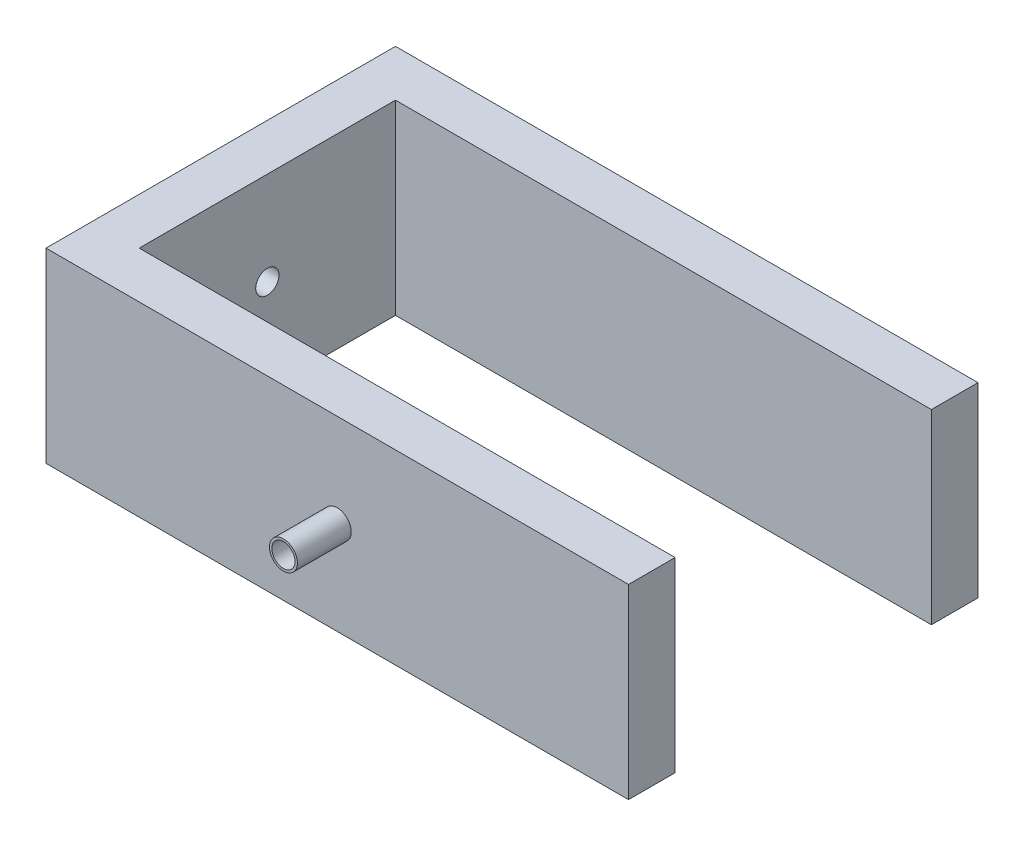
ISO-10303-21;
HEADER;
FILE_DESCRIPTION(('STEP AP214'),'2;1');
FILE_NAME('part.step','',(''),(''),'','','');
FILE_SCHEMA(('AUTOMOTIVE_DESIGN { 1 0 10303 214 1 1 1 1 }'));
ENDSEC;
DATA;
#1=APPLICATION_CONTEXT('core data for automotive mechanical design processes');
#2=APPLICATION_PROTOCOL_DEFINITION('international standard','automotive_design',2000,#1);
#3=PRODUCT_CONTEXT('',#1,'mechanical');
#4=PRODUCT('Part','Part','',(#3));
#5=PRODUCT_RELATED_PRODUCT_CATEGORY('part','',(#4));
#6=PRODUCT_DEFINITION_FORMATION('','',#4);
#7=PRODUCT_DEFINITION_CONTEXT('part definition',#1,'design');
#8=PRODUCT_DEFINITION('design','',#6,#7);
#9=PRODUCT_DEFINITION_SHAPE('','',#8);
#10=(LENGTH_UNIT() NAMED_UNIT(*) SI_UNIT(.MILLI.,.METRE.));
#11=(NAMED_UNIT(*) PLANE_ANGLE_UNIT() SI_UNIT($,.RADIAN.));
#12=(NAMED_UNIT(*) SI_UNIT($,.STERADIAN.) SOLID_ANGLE_UNIT());
#13=UNCERTAINTY_MEASURE_WITH_UNIT(LENGTH_MEASURE(1.E-05),#10,'distance_accuracy_value','');
#14=(GEOMETRIC_REPRESENTATION_CONTEXT(3) GLOBAL_UNCERTAINTY_ASSIGNED_CONTEXT((#13)) GLOBAL_UNIT_ASSIGNED_CONTEXT((#10,
#11,#12)) REPRESENTATION_CONTEXT('',''));
#15=CARTESIAN_POINT('',(0.,0.,0.));
#16=DIRECTION('',(0.,0.,1.));
#17=DIRECTION('',(1.,0.,0.));
#18=AXIS2_PLACEMENT_3D('',#15,#16,#17);
#19=CARTESIAN_POINT('',(10.,0.,0.));
#20=DIRECTION('',(1.,0.,0.));
#21=DIRECTION('',(0.,0.,-1.));
#22=AXIS2_PLACEMENT_3D('',#19,#20,#21);
#23=PLANE('',#22);
#24=CARTESIAN_POINT('',(10.,0.,0.));
#25=DIRECTION('',(1.,0.,0.));
#26=DIRECTION('',(0.,0.,-1.));
#27=AXIS2_PLACEMENT_3D('',#24,#25,#26);
#28=CIRCLE('',#27,2.5);
#29=CARTESIAN_POINT('',(10.,0.,-2.5));
#30=VERTEX_POINT('',#29);
#31=EDGE_CURVE('E147',#30,#30,#28,.T.);
#32=ORIENTED_EDGE('',*,*,#31,.F.);
#33=EDGE_LOOP('',(#32));
#34=FACE_BOUND('',#33,.T.);
#35=DIRECTION('',(0.,0.,1.));
#36=VECTOR('',#35,1.);
#37=CARTESIAN_POINT('',(10.,20.,37.5));
#38=LINE('',#37,#36);
#39=CARTESIAN_POINT('',(10.,20.,-27.5));
#40=VERTEX_POINT('',#39);
#41=CARTESIAN_POINT('',(10.,20.,27.5));
#42=VERTEX_POINT('',#41);
#43=EDGE_CURVE('E52',#40,#42,#38,.T.);
#44=ORIENTED_EDGE('',*,*,#43,.T.);
#45=DIRECTION('',(0.,-1.,0.));
#46=VECTOR('',#45,1.);
#47=CARTESIAN_POINT('',(10.,0.,27.5));
#48=LINE('',#47,#46);
#49=CARTESIAN_POINT('',(10.,-20.,27.5));
#50=VERTEX_POINT('',#49);
#51=EDGE_CURVE('E47',#42,#50,#48,.T.);
#52=ORIENTED_EDGE('',*,*,#51,.T.);
#53=DIRECTION('',(0.,0.,-1.));
#54=VECTOR('',#53,1.);
#55=CARTESIAN_POINT('',(10.,-20.,37.5));
#56=LINE('',#55,#54);
#57=CARTESIAN_POINT('',(10.,-20.,-27.5));
#58=VERTEX_POINT('',#57);
#59=EDGE_CURVE('E102',#50,#58,#56,.T.);
#60=ORIENTED_EDGE('',*,*,#59,.T.);
#61=DIRECTION('',(0.,-1.,0.));
#62=VECTOR('',#61,1.);
#63=CARTESIAN_POINT('',(10.,0.,-27.5));
#64=LINE('',#63,#62);
#65=EDGE_CURVE('E141',#40,#58,#64,.T.);
#66=ORIENTED_EDGE('',*,*,#65,.F.);
#67=EDGE_LOOP('',(#44,#52,#60,#66));
#68=FACE_BOUND('',#67,.T.);
#69=ADVANCED_FACE('F32',(#34,#68),#23,.T.);
#70=CARTESIAN_POINT('',(0.,0.,0.));
#71=DIRECTION('',(1.,0.,0.));
#72=DIRECTION('',(0.,0.,-1.));
#73=AXIS2_PLACEMENT_3D('',#70,#71,#72);
#74=PLANE('',#73);
#75=DIRECTION('',(0.,-1.,0.));
#76=VECTOR('',#75,1.);
#77=CARTESIAN_POINT('',(0.,20.,37.5));
#78=LINE('',#77,#76);
#79=CARTESIAN_POINT('',(0.,20.,37.5));
#80=VERTEX_POINT('',#79);
#81=CARTESIAN_POINT('',(0.,-20.,37.5));
#82=VERTEX_POINT('',#81);
#83=EDGE_CURVE('E150',#80,#82,#78,.T.);
#84=ORIENTED_EDGE('',*,*,#83,.F.);
#85=DIRECTION('',(0.,0.,1.));
#86=VECTOR('',#85,1.);
#87=CARTESIAN_POINT('',(0.,20.,37.5));
#88=LINE('',#87,#86);
#89=CARTESIAN_POINT('',(0.,20.,-37.5));
#90=VERTEX_POINT('',#89);
#91=EDGE_CURVE('E154',#90,#80,#88,.T.);
#92=ORIENTED_EDGE('',*,*,#91,.F.);
#93=DIRECTION('',(0.,1.,0.));
#94=VECTOR('',#93,1.);
#95=CARTESIAN_POINT('',(0.,20.,-37.5));
#96=LINE('',#95,#94);
#97=CARTESIAN_POINT('',(0.,-20.,-37.5));
#98=VERTEX_POINT('',#97);
#99=EDGE_CURVE('E161',#98,#90,#96,.T.);
#100=ORIENTED_EDGE('',*,*,#99,.F.);
#101=DIRECTION('',(0.,0.,-1.));
#102=VECTOR('',#101,1.);
#103=CARTESIAN_POINT('',(0.,-20.,37.5));
#104=LINE('',#103,#102);
#105=EDGE_CURVE('E159',#82,#98,#104,.T.);
#106=ORIENTED_EDGE('',*,*,#105,.F.);
#107=EDGE_LOOP('',(#84,#92,#100,#106));
#108=FACE_BOUND('',#107,.T.);
#109=CARTESIAN_POINT('',(0.,0.,0.));
#110=DIRECTION('',(1.,0.,0.));
#111=DIRECTION('',(0.,0.,-1.));
#112=AXIS2_PLACEMENT_3D('',#109,#110,#111);
#113=CIRCLE('',#112,2.5);
#114=CARTESIAN_POINT('',(0.,0.,-2.5));
#115=VERTEX_POINT('',#114);
#116=EDGE_CURVE('E146',#115,#115,#113,.T.);
#117=ORIENTED_EDGE('',*,*,#116,.T.);
#118=EDGE_LOOP('',(#117));
#119=FACE_BOUND('',#118,.T.);
#120=ADVANCED_FACE('F190',(#108,#119),#74,.F.);
#121=CARTESIAN_POINT('',(10.,20.,37.5));
#122=DIRECTION('',(0.,0.,-1.));
#123=DIRECTION('',(0.,1.,0.));
#124=AXIS2_PLACEMENT_3D('',#121,#122,#123);
#125=PLANE('',#124);
#126=CARTESIAN_POINT('',(62.5,0.,37.5));
#127=DIRECTION('',(0.,0.,-1.));
#128=DIRECTION('',(-1.,0.,0.));
#129=AXIS2_PLACEMENT_3D('',#126,#127,#128);
#130=CIRCLE('',#129,3.00000000000001);
#131=CARTESIAN_POINT('',(59.5,0.,37.5));
#132=VERTEX_POINT('',#131);
#133=EDGE_CURVE('E376',#132,#132,#130,.T.);
#134=ORIENTED_EDGE('',*,*,#133,.T.);
#135=EDGE_LOOP('',(#134));
#136=FACE_BOUND('',#135,.T.);
#137=ORIENTED_EDGE('',*,*,#83,.T.);
#138=DIRECTION('',(-1.,0.,0.));
#139=VECTOR('',#138,1.);
#140=CARTESIAN_POINT('',(10.,-20.,37.5));
#141=LINE('',#140,#139);
#142=CARTESIAN_POINT('',(125.,-20.,37.5));
#143=VERTEX_POINT('',#142);
#144=EDGE_CURVE('E172',#143,#82,#141,.T.);
#145=ORIENTED_EDGE('',*,*,#144,.F.);
#146=DIRECTION('',(0.,1.,0.));
#147=VECTOR('',#146,1.);
#148=CARTESIAN_POINT('',(125.,20.,37.5));
#149=LINE('',#148,#147);
#150=CARTESIAN_POINT('',(125.,20.,37.5));
#151=VERTEX_POINT('',#150);
#152=EDGE_CURVE('E106',#143,#151,#149,.T.);
#153=ORIENTED_EDGE('',*,*,#152,.T.);
#154=DIRECTION('',(-1.,0.,0.));
#155=VECTOR('',#154,1.);
#156=CARTESIAN_POINT('',(10.,20.,37.5));
#157=LINE('',#156,#155);
#158=EDGE_CURVE('E156',#151,#80,#157,.T.);
#159=ORIENTED_EDGE('',*,*,#158,.T.);
#160=EDGE_LOOP('',(#137,#145,#153,#159));
#161=FACE_BOUND('',#160,.T.);
#162=ADVANCED_FACE('F34',(#136,#161),#125,.F.);
#163=CARTESIAN_POINT('',(10.,-20.,37.5));
#164=DIRECTION('',(0.,1.,0.));
#165=DIRECTION('',(0.,0.,1.));
#166=AXIS2_PLACEMENT_3D('',#163,#164,#165);
#167=PLANE('',#166);
#168=ORIENTED_EDGE('',*,*,#105,.T.);
#169=DIRECTION('',(-1.,0.,0.));
#170=VECTOR('',#169,1.);
#171=CARTESIAN_POINT('',(10.,-20.,-37.5));
#172=LINE('',#171,#170);
#173=CARTESIAN_POINT('',(125.,-20.,-37.5));
#174=VERTEX_POINT('',#173);
#175=EDGE_CURVE('E169',#174,#98,#172,.T.);
#176=ORIENTED_EDGE('',*,*,#175,.F.);
#177=DIRECTION('',(0.,0.,-1.));
#178=VECTOR('',#177,1.);
#179=CARTESIAN_POINT('',(125.,-20.,-27.5));
#180=LINE('',#179,#178);
#181=CARTESIAN_POINT('',(125.,-20.,-27.5));
#182=VERTEX_POINT('',#181);
#183=EDGE_CURVE('E138',#182,#174,#180,.T.);
#184=ORIENTED_EDGE('',*,*,#183,.F.);
#185=DIRECTION('',(-1.,0.,0.));
#186=VECTOR('',#185,1.);
#187=CARTESIAN_POINT('',(0.,-20.,-27.5));
#188=LINE('',#187,#186);
#189=EDGE_CURVE('E133',#182,#58,#188,.T.);
#190=ORIENTED_EDGE('',*,*,#189,.T.);
#191=ORIENTED_EDGE('',*,*,#59,.F.);
#192=DIRECTION('',(1.,0.,0.));
#193=VECTOR('',#192,1.);
#194=CARTESIAN_POINT('',(0.,-20.,27.5));
#195=LINE('',#194,#193);
#196=CARTESIAN_POINT('',(125.,-20.,27.5));
#197=VERTEX_POINT('',#196);
#198=EDGE_CURVE('E95',#50,#197,#195,.T.);
#199=ORIENTED_EDGE('',*,*,#198,.T.);
#200=DIRECTION('',(0.,0.,1.));
#201=VECTOR('',#200,1.);
#202=CARTESIAN_POINT('',(125.,-20.,27.5));
#203=LINE('',#202,#201);
#204=EDGE_CURVE('E99',#197,#143,#203,.T.);
#205=ORIENTED_EDGE('',*,*,#204,.T.);
#206=ORIENTED_EDGE('',*,*,#144,.T.);
#207=EDGE_LOOP('',(#168,#176,#184,#190,#191,#199,#205,#206));
#208=FACE_BOUND('',#207,.T.);
#209=ADVANCED_FACE('F97',(#208),#167,.F.);
#210=CARTESIAN_POINT('',(10.,20.,-37.5));
#211=DIRECTION('',(0.,0.,1.));
#212=DIRECTION('',(1.,0.,0.));
#213=AXIS2_PLACEMENT_3D('',#210,#211,#212);
#214=PLANE('',#213);
#215=CARTESIAN_POINT('',(62.5,0.,-37.5));
#216=DIRECTION('',(0.,0.,1.));
#217=DIRECTION('',(1.,0.,0.));
#218=AXIS2_PLACEMENT_3D('',#215,#216,#217);
#219=CIRCLE('',#218,2.49999999999999);
#220=CARTESIAN_POINT('',(65.,0.,-37.5));
#221=VERTEX_POINT('',#220);
#222=EDGE_CURVE('E40',#221,#221,#219,.F.);
#223=ORIENTED_EDGE('',*,*,#222,.F.);
#224=EDGE_LOOP('',(#223));
#225=FACE_BOUND('',#224,.T.);
#226=ORIENTED_EDGE('',*,*,#99,.T.);
#227=DIRECTION('',(-1.,0.,0.));
#228=VECTOR('',#227,1.);
#229=CARTESIAN_POINT('',(10.,20.,-37.5));
#230=LINE('',#229,#228);
#231=CARTESIAN_POINT('',(125.,20.,-37.5));
#232=VERTEX_POINT('',#231);
#233=EDGE_CURVE('E166',#232,#90,#230,.T.);
#234=ORIENTED_EDGE('',*,*,#233,.F.);
#235=DIRECTION('',(0.,-1.,0.));
#236=VECTOR('',#235,1.);
#237=CARTESIAN_POINT('',(125.,20.,-37.5));
#238=LINE('',#237,#236);
#239=EDGE_CURVE('E127',#232,#174,#238,.T.);
#240=ORIENTED_EDGE('',*,*,#239,.T.);
#241=ORIENTED_EDGE('',*,*,#175,.T.);
#242=EDGE_LOOP('',(#226,#234,#240,#241));
#243=FACE_BOUND('',#242,.T.);
#244=ADVANCED_FACE('F178',(#225,#243),#214,.F.);
#245=CARTESIAN_POINT('',(10.,20.,37.5));
#246=DIRECTION('',(0.,-1.,0.));
#247=DIRECTION('',(0.,0.,-1.));
#248=AXIS2_PLACEMENT_3D('',#245,#246,#247);
#249=PLANE('',#248);
#250=ORIENTED_EDGE('',*,*,#158,.F.);
#251=DIRECTION('',(0.,0.,1.));
#252=VECTOR('',#251,1.);
#253=CARTESIAN_POINT('',(125.,20.,27.5));
#254=LINE('',#253,#252);
#255=CARTESIAN_POINT('',(125.,20.,27.5));
#256=VERTEX_POINT('',#255);
#257=EDGE_CURVE('E114',#256,#151,#254,.T.);
#258=ORIENTED_EDGE('',*,*,#257,.F.);
#259=DIRECTION('',(-1.,0.,0.));
#260=VECTOR('',#259,1.);
#261=CARTESIAN_POINT('',(0.,20.,27.5));
#262=LINE('',#261,#260);
#263=EDGE_CURVE('E115',#256,#42,#262,.T.);
#264=ORIENTED_EDGE('',*,*,#263,.T.);
#265=ORIENTED_EDGE('',*,*,#43,.F.);
#266=DIRECTION('',(1.,0.,0.));
#267=VECTOR('',#266,1.);
#268=CARTESIAN_POINT('',(0.,20.,-27.5));
#269=LINE('',#268,#267);
#270=CARTESIAN_POINT('',(125.,20.,-27.5));
#271=VERTEX_POINT('',#270);
#272=EDGE_CURVE('E128',#40,#271,#269,.T.);
#273=ORIENTED_EDGE('',*,*,#272,.T.);
#274=DIRECTION('',(0.,0.,-1.));
#275=VECTOR('',#274,1.);
#276=CARTESIAN_POINT('',(125.,20.,-27.5));
#277=LINE('',#276,#275);
#278=EDGE_CURVE('E135',#271,#232,#277,.T.);
#279=ORIENTED_EDGE('',*,*,#278,.T.);
#280=ORIENTED_EDGE('',*,*,#233,.T.);
#281=ORIENTED_EDGE('',*,*,#91,.T.);
#282=EDGE_LOOP('',(#250,#258,#264,#265,#273,#279,#280,#281));
#283=FACE_BOUND('',#282,.T.);
#284=ADVANCED_FACE('F181',(#283),#249,.F.);
#285=CARTESIAN_POINT('',(10.,0.,0.));
#286=DIRECTION('',(-1.,0.,0.));
#287=DIRECTION('',(0.,0.,1.));
#288=AXIS2_PLACEMENT_3D('',#285,#286,#287);
#289=CYLINDRICAL_SURFACE('',#288,2.5);
#290=ORIENTED_EDGE('',*,*,#31,.T.);
#291=EDGE_LOOP('',(#290));
#292=FACE_BOUND('',#291,.T.);
#293=ORIENTED_EDGE('',*,*,#116,.F.);
#294=EDGE_LOOP('',(#293));
#295=FACE_BOUND('',#294,.T.);
#296=ADVANCED_FACE('F201',(#292,#295),#289,.F.);
#297=CARTESIAN_POINT('',(125.,20.,-27.5));
#298=DIRECTION('',(1.,0.,0.));
#299=DIRECTION('',(0.,0.,-1.));
#300=AXIS2_PLACEMENT_3D('',#297,#298,#299);
#301=PLANE('',#300);
#302=ORIENTED_EDGE('',*,*,#239,.F.);
#303=ORIENTED_EDGE('',*,*,#278,.F.);
#304=DIRECTION('',(0.,-1.,0.));
#305=VECTOR('',#304,1.);
#306=CARTESIAN_POINT('',(125.,20.,-27.5));
#307=LINE('',#306,#305);
#308=EDGE_CURVE('E130',#271,#182,#307,.T.);
#309=ORIENTED_EDGE('',*,*,#308,.T.);
#310=ORIENTED_EDGE('',*,*,#183,.T.);
#311=EDGE_LOOP('',(#302,#303,#309,#310));
#312=FACE_BOUND('',#311,.T.);
#313=ADVANCED_FACE('F199',(#312),#301,.T.);
#314=CARTESIAN_POINT('',(0.,0.,-27.5));
#315=DIRECTION('',(0.,0.,1.));
#316=DIRECTION('',(1.,0.,0.));
#317=AXIS2_PLACEMENT_3D('',#314,#315,#316);
#318=PLANE('',#317);
#319=ORIENTED_EDGE('',*,*,#272,.F.);
#320=ORIENTED_EDGE('',*,*,#65,.T.);
#321=ORIENTED_EDGE('',*,*,#189,.F.);
#322=ORIENTED_EDGE('',*,*,#308,.F.);
#323=EDGE_LOOP('',(#319,#320,#321,#322));
#324=FACE_BOUND('',#323,.T.);
#325=ADVANCED_FACE('F196',(#324),#318,.T.);
#326=CARTESIAN_POINT('',(125.,20.,27.5));
#327=DIRECTION('',(1.,0.,0.));
#328=DIRECTION('',(0.,0.,-1.));
#329=AXIS2_PLACEMENT_3D('',#326,#327,#328);
#330=PLANE('',#329);
#331=ORIENTED_EDGE('',*,*,#152,.F.);
#332=ORIENTED_EDGE('',*,*,#204,.F.);
#333=DIRECTION('',(0.,1.,0.));
#334=VECTOR('',#333,1.);
#335=CARTESIAN_POINT('',(125.,20.,27.5));
#336=LINE('',#335,#334);
#337=EDGE_CURVE('E105',#197,#256,#336,.T.);
#338=ORIENTED_EDGE('',*,*,#337,.T.);
#339=ORIENTED_EDGE('',*,*,#257,.T.);
#340=EDGE_LOOP('',(#331,#332,#338,#339));
#341=FACE_BOUND('',#340,.T.);
#342=ADVANCED_FACE('F110',(#341),#330,.T.);
#343=CARTESIAN_POINT('',(0.,0.,27.5));
#344=DIRECTION('',(0.,0.,1.));
#345=DIRECTION('',(1.,0.,0.));
#346=AXIS2_PLACEMENT_3D('',#343,#344,#345);
#347=PLANE('',#346);
#348=ORIENTED_EDGE('',*,*,#51,.F.);
#349=ORIENTED_EDGE('',*,*,#263,.F.);
#350=ORIENTED_EDGE('',*,*,#337,.F.);
#351=ORIENTED_EDGE('',*,*,#198,.F.);
#352=EDGE_LOOP('',(#348,#349,#350,#351));
#353=FACE_BOUND('',#352,.T.);
#354=ADVANCED_FACE('F117',(#353),#347,.F.);
#355=CARTESIAN_POINT('',(62.5,0.,-49.05));
#356=DIRECTION('',(0.,0.,1.));
#357=DIRECTION('',(1.,0.,0.));
#358=AXIS2_PLACEMENT_3D('',#355,#356,#357);
#359=CYLINDRICAL_SURFACE('',#358,2.49999999999999);
#360=CARTESIAN_POINT('',(62.5,0.,-49.05));
#361=DIRECTION('',(0.,0.,-1.));
#362=DIRECTION('',(-1.,0.,0.));
#363=AXIS2_PLACEMENT_3D('',#360,#361,#362);
#364=CIRCLE('',#363,2.49999999999999);
#365=CARTESIAN_POINT('',(60.,0.,-49.05));
#366=VERTEX_POINT('',#365);
#367=EDGE_CURVE('E124',#366,#366,#364,.T.);
#368=ORIENTED_EDGE('',*,*,#367,.F.);
#369=EDGE_LOOP('',(#368));
#370=FACE_BOUND('',#369,.T.);
#371=ORIENTED_EDGE('',*,*,#222,.T.);
#372=EDGE_LOOP('',(#371));
#373=FACE_BOUND('',#372,.T.);
#374=ADVANCED_FACE('F176',(#370,#373),#359,.T.);
#375=CARTESIAN_POINT('',(62.5,0.,-49.05));
#376=DIRECTION('',(0.,0.,-1.));
#377=DIRECTION('',(-1.,0.,0.));
#378=AXIS2_PLACEMENT_3D('',#375,#376,#377);
#379=PLANE('',#378);
#380=ORIENTED_EDGE('',*,*,#367,.T.);
#381=EDGE_LOOP('',(#380));
#382=FACE_BOUND('',#381,.T.);
#383=ADVANCED_FACE('F250',(#382),#379,.T.);
#384=CARTESIAN_POINT('',(62.5,0.,49.05));
#385=DIRECTION('',(0.,0.,-1.));
#386=DIRECTION('',(-1.,0.,0.));
#387=AXIS2_PLACEMENT_3D('',#384,#385,#386);
#388=CYLINDRICAL_SURFACE('',#387,3.00000000000001);
#389=CARTESIAN_POINT('',(62.5,0.,49.05));
#390=DIRECTION('',(0.,0.,-1.));
#391=DIRECTION('',(-1.,0.,0.));
#392=AXIS2_PLACEMENT_3D('',#389,#390,#391);
#393=CIRCLE('',#392,3.00000000000001);
#394=CARTESIAN_POINT('',(59.5,0.,49.05));
#395=VERTEX_POINT('',#394);
#396=EDGE_CURVE('E374',#395,#395,#393,.T.);
#397=ORIENTED_EDGE('',*,*,#396,.T.);
#398=EDGE_LOOP('',(#397));
#399=FACE_BOUND('',#398,.T.);
#400=ORIENTED_EDGE('',*,*,#133,.F.);
#401=EDGE_LOOP('',(#400));
#402=FACE_BOUND('',#401,.T.);
#403=ADVANCED_FACE('F243',(#399,#402),#388,.T.);
#404=CARTESIAN_POINT('',(62.5,0.,49.05));
#405=DIRECTION('',(0.,0.,-1.));
#406=DIRECTION('',(-1.,0.,0.));
#407=AXIS2_PLACEMENT_3D('',#404,#405,#406);
#408=PLANE('',#407);
#409=CARTESIAN_POINT('',(62.5,0.,49.05));
#410=DIRECTION('',(0.,0.,-1.));
#411=DIRECTION('',(-1.,0.,0.));
#412=AXIS2_PLACEMENT_3D('',#409,#410,#411);
#413=CIRCLE('',#412,2.49999999999999);
#414=CARTESIAN_POINT('',(60.,0.,49.05));
#415=VERTEX_POINT('',#414);
#416=EDGE_CURVE('E379',#415,#415,#413,.T.);
#417=ORIENTED_EDGE('',*,*,#416,.T.);
#418=EDGE_LOOP('',(#417));
#419=FACE_BOUND('',#418,.T.);
#420=ORIENTED_EDGE('',*,*,#396,.F.);
#421=EDGE_LOOP('',(#420));
#422=FACE_BOUND('',#421,.T.);
#423=ADVANCED_FACE('F235',(#419,#422),#408,.F.);
#424=CARTESIAN_POINT('',(62.5,0.,49.05));
#425=DIRECTION('',(0.,0.,-1.));
#426=DIRECTION('',(-1.,0.,0.));
#427=AXIS2_PLACEMENT_3D('',#424,#425,#426);
#428=CYLINDRICAL_SURFACE('',#427,2.49999999999999);
#429=ORIENTED_EDGE('',*,*,#416,.F.);
#430=EDGE_LOOP('',(#429));
#431=FACE_BOUND('',#430,.T.);
#432=CARTESIAN_POINT('',(62.5,0.,37.5));
#433=DIRECTION('',(0.,0.,-1.));
#434=DIRECTION('',(0.,1.,0.));
#435=AXIS2_PLACEMENT_3D('',#432,#433,#434);
#436=CIRCLE('',#435,2.49999999999999);
#437=CARTESIAN_POINT('',(62.5,2.5,37.5));
#438=VERTEX_POINT('',#437);
#439=EDGE_CURVE('E11',#438,#438,#436,.T.);
#440=ORIENTED_EDGE('',*,*,#439,.T.);
#441=EDGE_LOOP('',(#440));
#442=FACE_BOUND('',#441,.T.);
#443=ADVANCED_FACE('F230',(#431,#442),#428,.F.);
#444=ORIENTED_EDGE('',*,*,#439,.F.);
#445=EDGE_LOOP('',(#444));
#446=FACE_BOUND('',#445,.T.);
#447=ADVANCED_FACE('F225',(#446),#125,.F.);
#448=CLOSED_SHELL('',(#69,#120,#162,#209,#244,#284,#296,#313,#325,#342,#354,#374,#383,#403,#423,
#443,#447));
#449=MANIFOLD_SOLID_BREP('B2',#448);
#450=ADVANCED_BREP_SHAPE_REPRESENTATION('',(#18,#449),#14);
#451=SHAPE_DEFINITION_REPRESENTATION(#9,#450);
ENDSEC;
END-ISO-10303-21;
